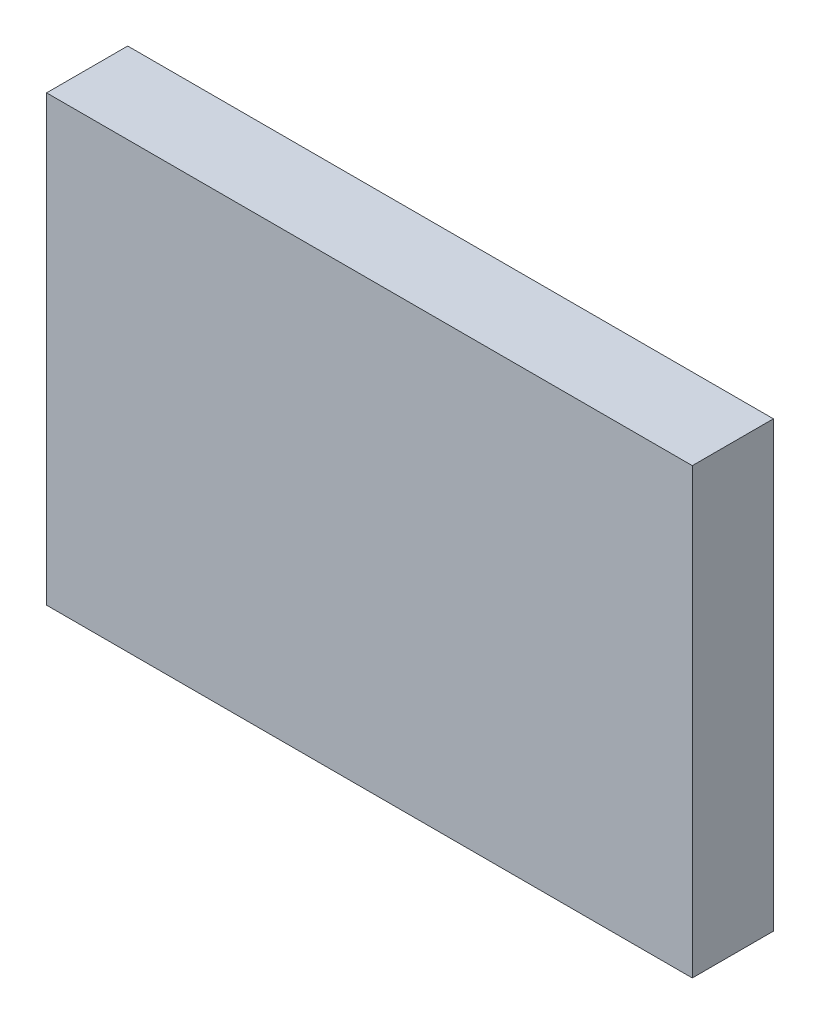
ISO-10303-21;
HEADER;
FILE_DESCRIPTION(('STEP AP214'),'2;1');
FILE_NAME('part.step','',(''),(''),'','','');
FILE_SCHEMA(('AUTOMOTIVE_DESIGN { 1 0 10303 214 1 1 1 1 }'));
ENDSEC;
DATA;
#1=APPLICATION_CONTEXT('core data for automotive mechanical design processes');
#2=APPLICATION_PROTOCOL_DEFINITION('international standard','automotive_design',2000,#1);
#3=PRODUCT_CONTEXT('',#1,'mechanical');
#4=PRODUCT('Part','Part','',(#3));
#5=PRODUCT_RELATED_PRODUCT_CATEGORY('part','',(#4));
#6=PRODUCT_DEFINITION_FORMATION('','',#4);
#7=PRODUCT_DEFINITION_CONTEXT('part definition',#1,'design');
#8=PRODUCT_DEFINITION('design','',#6,#7);
#9=PRODUCT_DEFINITION_SHAPE('','',#8);
#10=(LENGTH_UNIT() NAMED_UNIT(*) SI_UNIT(.MILLI.,.METRE.));
#11=(NAMED_UNIT(*) PLANE_ANGLE_UNIT() SI_UNIT($,.RADIAN.));
#12=(NAMED_UNIT(*) SI_UNIT($,.STERADIAN.) SOLID_ANGLE_UNIT());
#13=UNCERTAINTY_MEASURE_WITH_UNIT(LENGTH_MEASURE(1.E-05),#10,'distance_accuracy_value','');
#14=(GEOMETRIC_REPRESENTATION_CONTEXT(3) GLOBAL_UNCERTAINTY_ASSIGNED_CONTEXT((#13)) GLOBAL_UNIT_ASSIGNED_CONTEXT((#10,
#11,#12)) REPRESENTATION_CONTEXT('',''));
#15=CARTESIAN_POINT('',(0.,0.,0.));
#16=DIRECTION('',(0.,0.,1.));
#17=DIRECTION('',(1.,0.,0.));
#18=AXIS2_PLACEMENT_3D('',#15,#16,#17);
#19=CARTESIAN_POINT('',(-1.549,0.775,0.));
#20=DIRECTION('',(0.,-1.,0.));
#21=DIRECTION('',(0.,0.,-1.));
#22=AXIS2_PLACEMENT_3D('',#19,#20,#21);
#23=PLANE('',#22);
#24=DIRECTION('',(-1.,0.,0.));
#25=VECTOR('',#24,1.);
#26=CARTESIAN_POINT('',(-1.143,0.775,0.));
#27=LINE('',#26,#25);
#28=CARTESIAN_POINT('',(-1.143,0.775,0.));
#29=VERTEX_POINT('',#28);
#30=CARTESIAN_POINT('',(-1.549,0.775,0.));
#31=VERTEX_POINT('',#30);
#32=EDGE_CURVE('E11',#29,#31,#27,.T.);
#33=ORIENTED_EDGE('',*,*,#32,.F.);
#34=DIRECTION('',(0.,0.,-1.));
#35=VECTOR('',#34,1.);
#36=CARTESIAN_POINT('',(-1.143,0.775,0.051));
#37=LINE('',#36,#35);
#38=CARTESIAN_POINT('',(-1.143,0.775,0.051));
#39=VERTEX_POINT('',#38);
#40=EDGE_CURVE('E24',#39,#29,#37,.T.);
#41=ORIENTED_EDGE('',*,*,#40,.F.);
#42=DIRECTION('',(1.,0.,0.));
#43=VECTOR('',#42,1.);
#44=CARTESIAN_POINT('',(-1.549,0.775,0.051));
#45=LINE('',#44,#43);
#46=CARTESIAN_POINT('',(-1.549,0.775,0.051));
#47=VERTEX_POINT('',#46);
#48=EDGE_CURVE('E88',#47,#39,#45,.T.);
#49=ORIENTED_EDGE('',*,*,#48,.F.);
#50=DIRECTION('',(0.,0.,1.));
#51=VECTOR('',#50,1.);
#52=CARTESIAN_POINT('',(-1.549,0.775,0.));
#53=LINE('',#52,#51);
#54=EDGE_CURVE('E77',#31,#47,#53,.T.);
#55=ORIENTED_EDGE('',*,*,#54,.F.);
#56=EDGE_LOOP('',(#33,#41,#49,#55));
#57=FACE_BOUND('',#56,.T.);
#58=ADVANCED_FACE('F17',(#57),#23,.T.);
#59=CARTESIAN_POINT('',(-1.143,0.775,0.));
#60=DIRECTION('',(1.,0.,0.));
#61=DIRECTION('',(0.,1.,0.));
#62=AXIS2_PLACEMENT_3D('',#59,#60,#61);
#63=PLANE('',#62);
#64=DIRECTION('',(0.,-1.,0.));
#65=VECTOR('',#64,1.);
#66=CARTESIAN_POINT('',(-1.143,1.054,0.));
#67=LINE('',#66,#65);
#68=CARTESIAN_POINT('',(-1.143,1.054,0.));
#69=VERTEX_POINT('',#68);
#70=EDGE_CURVE('E85',#69,#29,#67,.T.);
#71=ORIENTED_EDGE('',*,*,#70,.F.);
#72=DIRECTION('',(0.,0.,-1.));
#73=VECTOR('',#72,1.);
#74=CARTESIAN_POINT('',(-1.143,1.054,0.051));
#75=LINE('',#74,#73);
#76=CARTESIAN_POINT('',(-1.143,1.054,0.051));
#77=VERTEX_POINT('',#76);
#78=EDGE_CURVE('E83',#77,#69,#75,.T.);
#79=ORIENTED_EDGE('',*,*,#78,.F.);
#80=DIRECTION('',(0.,1.,0.));
#81=VECTOR('',#80,1.);
#82=CARTESIAN_POINT('',(-1.143,0.775,0.051));
#83=LINE('',#82,#81);
#84=EDGE_CURVE('E72',#39,#77,#83,.T.);
#85=ORIENTED_EDGE('',*,*,#84,.F.);
#86=ORIENTED_EDGE('',*,*,#40,.T.);
#87=EDGE_LOOP('',(#71,#79,#85,#86));
#88=FACE_BOUND('',#87,.T.);
#89=ADVANCED_FACE('F90',(#88),#63,.T.);
#90=CARTESIAN_POINT('',(-1.143,1.054,0.));
#91=DIRECTION('',(0.,1.,0.));
#92=DIRECTION('',(1.,0.,0.));
#93=AXIS2_PLACEMENT_3D('',#90,#91,#92);
#94=PLANE('',#93);
#95=DIRECTION('',(1.,0.,0.));
#96=VECTOR('',#95,1.);
#97=CARTESIAN_POINT('',(-1.549,1.054,0.));
#98=LINE('',#97,#96);
#99=CARTESIAN_POINT('',(-1.549,1.054,0.));
#100=VERTEX_POINT('',#99);
#101=EDGE_CURVE('E60',#100,#69,#98,.T.);
#102=ORIENTED_EDGE('',*,*,#101,.F.);
#103=DIRECTION('',(0.,0.,-1.));
#104=VECTOR('',#103,1.);
#105=CARTESIAN_POINT('',(-1.549,1.054,0.051));
#106=LINE('',#105,#104);
#107=CARTESIAN_POINT('',(-1.549,1.054,0.051));
#108=VERTEX_POINT('',#107);
#109=EDGE_CURVE('E54',#108,#100,#106,.T.);
#110=ORIENTED_EDGE('',*,*,#109,.F.);
#111=DIRECTION('',(-1.,0.,0.));
#112=VECTOR('',#111,1.);
#113=CARTESIAN_POINT('',(-1.143,1.054,0.051));
#114=LINE('',#113,#112);
#115=EDGE_CURVE('E58',#77,#108,#114,.T.);
#116=ORIENTED_EDGE('',*,*,#115,.F.);
#117=ORIENTED_EDGE('',*,*,#78,.T.);
#118=EDGE_LOOP('',(#102,#110,#116,#117));
#119=FACE_BOUND('',#118,.T.);
#120=ADVANCED_FACE('F56',(#119),#94,.T.);
#121=CARTESIAN_POINT('',(-1.549,1.054,0.));
#122=DIRECTION('',(-1.,0.,0.));
#123=DIRECTION('',(0.,0.,1.));
#124=AXIS2_PLACEMENT_3D('',#121,#122,#123);
#125=PLANE('',#124);
#126=DIRECTION('',(0.,1.,0.));
#127=VECTOR('',#126,1.);
#128=CARTESIAN_POINT('',(-1.549,0.775,0.));
#129=LINE('',#128,#127);
#130=EDGE_CURVE('E73',#31,#100,#129,.T.);
#131=ORIENTED_EDGE('',*,*,#130,.F.);
#132=ORIENTED_EDGE('',*,*,#54,.T.);
#133=DIRECTION('',(0.,-1.,0.));
#134=VECTOR('',#133,1.);
#135=CARTESIAN_POINT('',(-1.549,1.054,0.051));
#136=LINE('',#135,#134);
#137=EDGE_CURVE('E70',#108,#47,#136,.T.);
#138=ORIENTED_EDGE('',*,*,#137,.F.);
#139=ORIENTED_EDGE('',*,*,#109,.T.);
#140=EDGE_LOOP('',(#131,#132,#138,#139));
#141=FACE_BOUND('',#140,.T.);
#142=ADVANCED_FACE('F76',(#141),#125,.T.);
#143=CARTESIAN_POINT('',(-1.549,1.054,0.));
#144=DIRECTION('',(0.,0.,-1.));
#145=DIRECTION('',(0.,-1.,0.));
#146=AXIS2_PLACEMENT_3D('',#143,#144,#145);
#147=PLANE('',#146);
#148=ORIENTED_EDGE('',*,*,#101,.T.);
#149=ORIENTED_EDGE('',*,*,#70,.T.);
#150=ORIENTED_EDGE('',*,*,#32,.T.);
#151=ORIENTED_EDGE('',*,*,#130,.T.);
#152=EDGE_LOOP('',(#148,#149,#150,#151));
#153=FACE_BOUND('',#152,.T.);
#154=ADVANCED_FACE('F91',(#153),#147,.T.);
#155=CARTESIAN_POINT('',(-1.549,0.775,0.051));
#156=DIRECTION('',(0.,0.,1.));
#157=DIRECTION('',(1.,0.,0.));
#158=AXIS2_PLACEMENT_3D('',#155,#156,#157);
#159=PLANE('',#158);
#160=ORIENTED_EDGE('',*,*,#48,.T.);
#161=ORIENTED_EDGE('',*,*,#84,.T.);
#162=ORIENTED_EDGE('',*,*,#115,.T.);
#163=ORIENTED_EDGE('',*,*,#137,.T.);
#164=EDGE_LOOP('',(#160,#161,#162,#163));
#165=FACE_BOUND('',#164,.T.);
#166=ADVANCED_FACE('F69',(#165),#159,.T.);
#167=CLOSED_SHELL('',(#58,#89,#120,#142,#154,#166));
#168=MANIFOLD_SOLID_BREP('B1',#167);
#169=ADVANCED_BREP_SHAPE_REPRESENTATION('',(#18,#168),#14);
#170=SHAPE_DEFINITION_REPRESENTATION(#9,#169);
ENDSEC;
END-ISO-10303-21;
